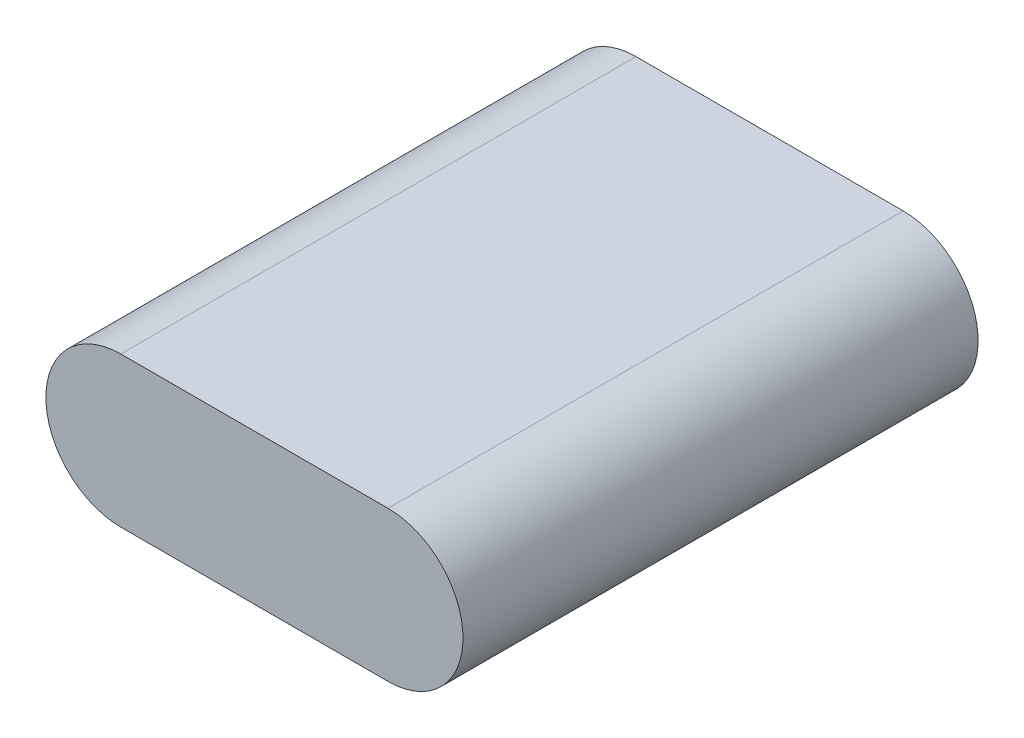
ISO-10303-21;
HEADER;
FILE_DESCRIPTION(('STEP AP214'),'2;1');
FILE_NAME('part.step','',(''),(''),'','','');
FILE_SCHEMA(('AUTOMOTIVE_DESIGN { 1 0 10303 214 1 1 1 1 }'));
ENDSEC;
DATA;
#1=APPLICATION_CONTEXT('core data for automotive mechanical design processes');
#2=APPLICATION_PROTOCOL_DEFINITION('international standard','automotive_design',2000,#1);
#3=PRODUCT_CONTEXT('',#1,'mechanical');
#4=PRODUCT('Part','Part','',(#3));
#5=PRODUCT_RELATED_PRODUCT_CATEGORY('part','',(#4));
#6=PRODUCT_DEFINITION_FORMATION('','',#4);
#7=PRODUCT_DEFINITION_CONTEXT('part definition',#1,'design');
#8=PRODUCT_DEFINITION('design','',#6,#7);
#9=PRODUCT_DEFINITION_SHAPE('','',#8);
#10=(LENGTH_UNIT() NAMED_UNIT(*) SI_UNIT(.MILLI.,.METRE.));
#11=(NAMED_UNIT(*) PLANE_ANGLE_UNIT() SI_UNIT($,.RADIAN.));
#12=(NAMED_UNIT(*) SI_UNIT($,.STERADIAN.) SOLID_ANGLE_UNIT());
#13=UNCERTAINTY_MEASURE_WITH_UNIT(LENGTH_MEASURE(1.E-05),#10,'distance_accuracy_value','');
#14=(GEOMETRIC_REPRESENTATION_CONTEXT(3) GLOBAL_UNCERTAINTY_ASSIGNED_CONTEXT((#13)) GLOBAL_UNIT_ASSIGNED_CONTEXT((#10,
#11,#12)) REPRESENTATION_CONTEXT('',''));
#15=CARTESIAN_POINT('',(0.,0.,0.));
#16=DIRECTION('',(0.,0.,1.));
#17=DIRECTION('',(1.,0.,0.));
#18=AXIS2_PLACEMENT_3D('',#15,#16,#17);
#19=CARTESIAN_POINT('',(-17.653,0.,68.072));
#20=DIRECTION('',(0.,0.,-1.));
#21=DIRECTION('',(-1.,0.,0.));
#22=AXIS2_PLACEMENT_3D('',#19,#20,#21);
#23=CYLINDRICAL_SURFACE('',#22,9.906);
#24=CARTESIAN_POINT('',(-17.653,0.,0.));
#25=DIRECTION('',(0.,0.,1.));
#26=DIRECTION('',(1.,0.,0.));
#27=AXIS2_PLACEMENT_3D('',#24,#25,#26);
#28=CIRCLE('',#27,9.906);
#29=CARTESIAN_POINT('',(-17.653,9.906,0.));
#30=VERTEX_POINT('',#29);
#31=CARTESIAN_POINT('',(-17.653,-9.906,0.));
#32=VERTEX_POINT('',#31);
#33=EDGE_CURVE('E113',#30,#32,#28,.T.);
#34=ORIENTED_EDGE('',*,*,#33,.T.);
#35=DIRECTION('',(0.,0.,-1.));
#36=VECTOR('',#35,1.);
#37=CARTESIAN_POINT('',(-17.653,-9.906,68.072));
#38=LINE('',#37,#36);
#39=CARTESIAN_POINT('',(-17.653,-9.906,68.072));
#40=VERTEX_POINT('',#39);
#41=EDGE_CURVE('E11',#40,#32,#38,.T.);
#42=ORIENTED_EDGE('',*,*,#41,.F.);
#43=CARTESIAN_POINT('',(-17.653,0.,68.072));
#44=DIRECTION('',(0.,0.,1.));
#45=DIRECTION('',(1.,0.,0.));
#46=AXIS2_PLACEMENT_3D('',#43,#44,#45);
#47=CIRCLE('',#46,9.906);
#48=CARTESIAN_POINT('',(-17.653,9.906,68.072));
#49=VERTEX_POINT('',#48);
#50=EDGE_CURVE('E97',#49,#40,#47,.T.);
#51=ORIENTED_EDGE('',*,*,#50,.F.);
#52=DIRECTION('',(0.,0.,-1.));
#53=VECTOR('',#52,1.);
#54=CARTESIAN_POINT('',(-17.653,9.906,68.072));
#55=LINE('',#54,#53);
#56=EDGE_CURVE('E109',#49,#30,#55,.T.);
#57=ORIENTED_EDGE('',*,*,#56,.T.);
#58=EDGE_LOOP('',(#34,#42,#51,#57));
#59=FACE_BOUND('',#58,.T.);
#60=ADVANCED_FACE('F45',(#59),#23,.T.);
#61=CARTESIAN_POINT('',(-17.653,-9.906,68.072));
#62=DIRECTION('',(0.,1.,0.));
#63=DIRECTION('',(-1.,0.,0.));
#64=AXIS2_PLACEMENT_3D('',#61,#62,#63);
#65=PLANE('',#64);
#66=DIRECTION('',(1.,0.,0.));
#67=VECTOR('',#66,1.);
#68=CARTESIAN_POINT('',(-17.653,-9.906,0.));
#69=LINE('',#68,#67);
#70=CARTESIAN_POINT('',(17.653,-9.90599999999999,0.));
#71=VERTEX_POINT('',#70);
#72=EDGE_CURVE('E102',#32,#71,#69,.T.);
#73=ORIENTED_EDGE('',*,*,#72,.T.);
#74=DIRECTION('',(0.,0.,-1.));
#75=VECTOR('',#74,1.);
#76=CARTESIAN_POINT('',(17.653,-9.90599999999999,68.072));
#77=LINE('',#76,#75);
#78=CARTESIAN_POINT('',(17.653,-9.90599999999999,68.072));
#79=VERTEX_POINT('',#78);
#80=EDGE_CURVE('E54',#79,#71,#77,.T.);
#81=ORIENTED_EDGE('',*,*,#80,.F.);
#82=DIRECTION('',(1.,0.,0.));
#83=VECTOR('',#82,1.);
#84=CARTESIAN_POINT('',(-17.653,-9.906,68.072));
#85=LINE('',#84,#83);
#86=EDGE_CURVE('E92',#40,#79,#85,.T.);
#87=ORIENTED_EDGE('',*,*,#86,.F.);
#88=ORIENTED_EDGE('',*,*,#41,.T.);
#89=EDGE_LOOP('',(#73,#81,#87,#88));
#90=FACE_BOUND('',#89,.T.);
#91=ADVANCED_FACE('F101',(#90),#65,.F.);
#92=CARTESIAN_POINT('',(17.653,0.,68.072));
#93=DIRECTION('',(0.,0.,-1.));
#94=DIRECTION('',(-1.,0.,0.));
#95=AXIS2_PLACEMENT_3D('',#92,#93,#94);
#96=CYLINDRICAL_SURFACE('',#95,9.906);
#97=CARTESIAN_POINT('',(17.653,0.,0.));
#98=DIRECTION('',(0.,0.,1.));
#99=DIRECTION('',(1.,0.,0.));
#100=AXIS2_PLACEMENT_3D('',#97,#98,#99);
#101=CIRCLE('',#100,9.906);
#102=CARTESIAN_POINT('',(17.653,9.90600000000001,0.));
#103=VERTEX_POINT('',#102);
#104=EDGE_CURVE('E79',#71,#103,#101,.T.);
#105=ORIENTED_EDGE('',*,*,#104,.T.);
#106=DIRECTION('',(0.,0.,-1.));
#107=VECTOR('',#106,1.);
#108=CARTESIAN_POINT('',(17.653,9.90600000000001,68.072));
#109=LINE('',#108,#107);
#110=CARTESIAN_POINT('',(17.653,9.90600000000001,68.072));
#111=VERTEX_POINT('',#110);
#112=EDGE_CURVE('E104',#111,#103,#109,.T.);
#113=ORIENTED_EDGE('',*,*,#112,.F.);
#114=CARTESIAN_POINT('',(17.653,0.,68.072));
#115=DIRECTION('',(0.,0.,1.));
#116=DIRECTION('',(1.,0.,0.));
#117=AXIS2_PLACEMENT_3D('',#114,#115,#116);
#118=CIRCLE('',#117,9.906);
#119=EDGE_CURVE('E95',#79,#111,#118,.T.);
#120=ORIENTED_EDGE('',*,*,#119,.F.);
#121=ORIENTED_EDGE('',*,*,#80,.T.);
#122=EDGE_LOOP('',(#105,#113,#120,#121));
#123=FACE_BOUND('',#122,.T.);
#124=ADVANCED_FACE('F105',(#123),#96,.T.);
#125=CARTESIAN_POINT('',(-17.653,9.906,68.072));
#126=DIRECTION('',(0.,-1.,0.));
#127=DIRECTION('',(1.,0.,0.));
#128=AXIS2_PLACEMENT_3D('',#125,#126,#127);
#129=PLANE('',#128);
#130=DIRECTION('',(-1.,0.,0.));
#131=VECTOR('',#130,1.);
#132=CARTESIAN_POINT('',(-17.653,9.906,0.));
#133=LINE('',#132,#131);
#134=EDGE_CURVE('E85',#103,#30,#133,.T.);
#135=ORIENTED_EDGE('',*,*,#134,.T.);
#136=ORIENTED_EDGE('',*,*,#56,.F.);
#137=DIRECTION('',(-1.,0.,0.));
#138=VECTOR('',#137,1.);
#139=CARTESIAN_POINT('',(-17.653,9.906,68.072));
#140=LINE('',#139,#138);
#141=EDGE_CURVE('E62',#111,#49,#140,.T.);
#142=ORIENTED_EDGE('',*,*,#141,.F.);
#143=ORIENTED_EDGE('',*,*,#112,.T.);
#144=EDGE_LOOP('',(#135,#136,#142,#143));
#145=FACE_BOUND('',#144,.T.);
#146=ADVANCED_FACE('F126',(#145),#129,.F.);
#147=CARTESIAN_POINT('',(-17.653,0.,68.072));
#148=DIRECTION('',(0.,0.,1.));
#149=DIRECTION('',(1.,0.,0.));
#150=AXIS2_PLACEMENT_3D('',#147,#148,#149);
#151=PLANE('',#150);
#152=ORIENTED_EDGE('',*,*,#50,.T.);
#153=ORIENTED_EDGE('',*,*,#86,.T.);
#154=ORIENTED_EDGE('',*,*,#119,.T.);
#155=ORIENTED_EDGE('',*,*,#141,.T.);
#156=EDGE_LOOP('',(#152,#153,#154,#155));
#157=FACE_BOUND('',#156,.T.);
#158=ADVANCED_FACE('F93',(#157),#151,.T.);
#159=CARTESIAN_POINT('',(-17.653,0.,0.));
#160=DIRECTION('',(0.,0.,1.));
#161=DIRECTION('',(1.,0.,0.));
#162=AXIS2_PLACEMENT_3D('',#159,#160,#161);
#163=PLANE('',#162);
#164=ORIENTED_EDGE('',*,*,#33,.F.);
#165=ORIENTED_EDGE('',*,*,#134,.F.);
#166=ORIENTED_EDGE('',*,*,#104,.F.);
#167=ORIENTED_EDGE('',*,*,#72,.F.);
#168=EDGE_LOOP('',(#164,#165,#166,#167));
#169=FACE_BOUND('',#168,.T.);
#170=ADVANCED_FACE('F129',(#169),#163,.F.);
#171=CLOSED_SHELL('',(#60,#91,#124,#146,#158,#170));
#172=MANIFOLD_SOLID_BREP('B2',#171);
#173=ADVANCED_BREP_SHAPE_REPRESENTATION('',(#18,#172),#14);
#174=SHAPE_DEFINITION_REPRESENTATION(#9,#173);
ENDSEC;
END-ISO-10303-21;
